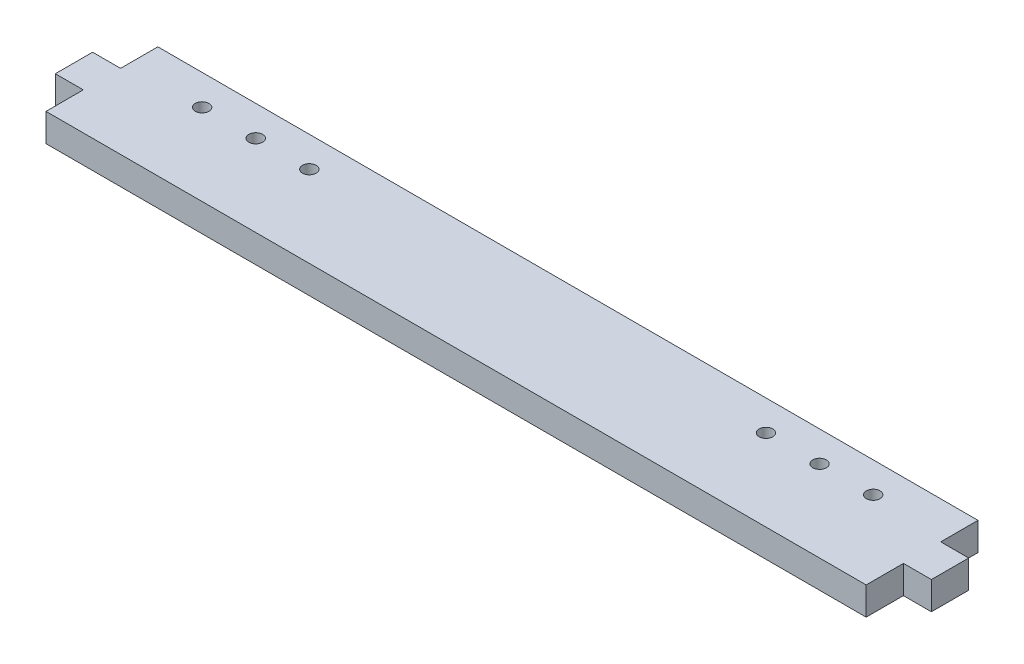
ISO-10303-21;
HEADER;
FILE_DESCRIPTION(('STEP AP214'),'2;1');
FILE_NAME('part.step','',(''),(''),'','','');
FILE_SCHEMA(('AUTOMOTIVE_DESIGN { 1 0 10303 214 1 1 1 1 }'));
ENDSEC;
DATA;
#1=APPLICATION_CONTEXT('core data for automotive mechanical design processes');
#2=APPLICATION_PROTOCOL_DEFINITION('international standard','automotive_design',2000,#1);
#3=PRODUCT_CONTEXT('',#1,'mechanical');
#4=PRODUCT('Part','Part','',(#3));
#5=PRODUCT_RELATED_PRODUCT_CATEGORY('part','',(#4));
#6=PRODUCT_DEFINITION_FORMATION('','',#4);
#7=PRODUCT_DEFINITION_CONTEXT('part definition',#1,'design');
#8=PRODUCT_DEFINITION('design','',#6,#7);
#9=PRODUCT_DEFINITION_SHAPE('','',#8);
#10=(LENGTH_UNIT() NAMED_UNIT(*) SI_UNIT(.MILLI.,.METRE.));
#11=(NAMED_UNIT(*) PLANE_ANGLE_UNIT() SI_UNIT($,.RADIAN.));
#12=(NAMED_UNIT(*) SI_UNIT($,.STERADIAN.) SOLID_ANGLE_UNIT());
#13=UNCERTAINTY_MEASURE_WITH_UNIT(LENGTH_MEASURE(1.E-05),#10,'distance_accuracy_value','');
#14=(GEOMETRIC_REPRESENTATION_CONTEXT(3) GLOBAL_UNCERTAINTY_ASSIGNED_CONTEXT((#13)) GLOBAL_UNIT_ASSIGNED_CONTEXT((#10,
#11,#12)) REPRESENTATION_CONTEXT('',''));
#15=CARTESIAN_POINT('',(0.,0.,0.));
#16=DIRECTION('',(0.,0.,1.));
#17=DIRECTION('',(1.,0.,0.));
#18=AXIS2_PLACEMENT_3D('',#15,#16,#17);
#19=CARTESIAN_POINT('',(-139.7,9.525,19.05));
#20=DIRECTION('',(1.,0.,0.));
#21=DIRECTION('',(0.,0.,-1.));
#22=AXIS2_PLACEMENT_3D('',#19,#20,#21);
#23=PLANE('',#22);
#24=DIRECTION('',(0.,0.,1.));
#25=VECTOR('',#24,1.);
#26=CARTESIAN_POINT('',(-139.7,9.525,19.05));
#27=LINE('',#26,#25);
#28=CARTESIAN_POINT('',(-139.7,9.525,6.34999999999999));
#29=VERTEX_POINT('',#28);
#30=CARTESIAN_POINT('',(-139.7,9.525,19.05));
#31=VERTEX_POINT('',#30);
#32=EDGE_CURVE('E193',#29,#31,#27,.T.);
#33=ORIENTED_EDGE('',*,*,#32,.F.);
#34=DIRECTION('',(0.,-1.,0.));
#35=VECTOR('',#34,1.);
#36=CARTESIAN_POINT('',(-139.7,0.,6.34999999999999));
#37=LINE('',#36,#35);
#38=CARTESIAN_POINT('',(-139.7,0.,6.34999999999999));
#39=VERTEX_POINT('',#38);
#40=EDGE_CURVE('E134',#29,#39,#37,.T.);
#41=ORIENTED_EDGE('',*,*,#40,.T.);
#42=DIRECTION('',(0.,0.,1.));
#43=VECTOR('',#42,1.);
#44=CARTESIAN_POINT('',(-139.7,0.,19.05));
#45=LINE('',#44,#43);
#46=CARTESIAN_POINT('',(-139.7,0.,19.05));
#47=VERTEX_POINT('',#46);
#48=EDGE_CURVE('E189',#39,#47,#45,.T.);
#49=ORIENTED_EDGE('',*,*,#48,.T.);
#50=DIRECTION('',(0.,-1.,0.));
#51=VECTOR('',#50,1.);
#52=CARTESIAN_POINT('',(-139.7,9.525,19.05));
#53=LINE('',#52,#51);
#54=EDGE_CURVE('E11',#31,#47,#53,.T.);
#55=ORIENTED_EDGE('',*,*,#54,.F.);
#56=EDGE_LOOP('',(#33,#41,#49,#55));
#57=FACE_BOUND('',#56,.T.);
#58=ADVANCED_FACE('F37',(#57),#23,.F.);
#59=CARTESIAN_POINT('',(139.7,9.525,19.05));
#60=DIRECTION('',(-1.,0.,0.));
#61=DIRECTION('',(0.,0.,1.));
#62=AXIS2_PLACEMENT_3D('',#59,#60,#61);
#63=PLANE('',#62);
#64=DIRECTION('',(0.,-1.,0.));
#65=VECTOR('',#64,1.);
#66=CARTESIAN_POINT('',(139.7,0.,6.34999999999999));
#67=LINE('',#66,#65);
#68=CARTESIAN_POINT('',(139.7,9.525,6.34999999999999));
#69=VERTEX_POINT('',#68);
#70=CARTESIAN_POINT('',(139.7,0.,6.34999999999999));
#71=VERTEX_POINT('',#70);
#72=EDGE_CURVE('E60',#69,#71,#67,.T.);
#73=ORIENTED_EDGE('',*,*,#72,.F.);
#74=DIRECTION('',(0.,0.,-1.));
#75=VECTOR('',#74,1.);
#76=CARTESIAN_POINT('',(139.7,9.525,19.05));
#77=LINE('',#76,#75);
#78=CARTESIAN_POINT('',(139.7,9.525,19.05));
#79=VERTEX_POINT('',#78);
#80=EDGE_CURVE('E196',#79,#69,#77,.T.);
#81=ORIENTED_EDGE('',*,*,#80,.F.);
#82=DIRECTION('',(0.,-1.,0.));
#83=VECTOR('',#82,1.);
#84=CARTESIAN_POINT('',(139.7,9.525,19.05));
#85=LINE('',#84,#83);
#86=CARTESIAN_POINT('',(139.7,0.,19.05));
#87=VERTEX_POINT('',#86);
#88=EDGE_CURVE('E45',#79,#87,#85,.T.);
#89=ORIENTED_EDGE('',*,*,#88,.T.);
#90=DIRECTION('',(0.,0.,-1.));
#91=VECTOR('',#90,1.);
#92=CARTESIAN_POINT('',(139.7,0.,19.05));
#93=LINE('',#92,#91);
#94=EDGE_CURVE('E207',#87,#71,#93,.T.);
#95=ORIENTED_EDGE('',*,*,#94,.T.);
#96=EDGE_LOOP('',(#73,#81,#89,#95));
#97=FACE_BOUND('',#96,.T.);
#98=ADVANCED_FACE('F218',(#97),#63,.F.);
#99=DIRECTION('',(0.,1.,0.));
#100=VECTOR('',#99,1.);
#101=CARTESIAN_POINT('',(139.7,0.,-6.35000000000001));
#102=LINE('',#101,#100);
#103=CARTESIAN_POINT('',(139.7,0.,-6.35000000000001));
#104=VERTEX_POINT('',#103);
#105=CARTESIAN_POINT('',(139.7,9.525,-6.35000000000001));
#106=VERTEX_POINT('',#105);
#107=EDGE_CURVE('E168',#104,#106,#102,.T.);
#108=ORIENTED_EDGE('',*,*,#107,.F.);
#109=CARTESIAN_POINT('',(139.7,0.,-19.05));
#110=VERTEX_POINT('',#109);
#111=EDGE_CURVE('E206',#104,#110,#93,.T.);
#112=ORIENTED_EDGE('',*,*,#111,.T.);
#113=DIRECTION('',(0.,-1.,0.));
#114=VECTOR('',#113,1.);
#115=CARTESIAN_POINT('',(139.7,9.525,-19.05));
#116=LINE('',#115,#114);
#117=CARTESIAN_POINT('',(139.7,9.525,-19.05));
#118=VERTEX_POINT('',#117);
#119=EDGE_CURVE('E213',#118,#110,#116,.T.);
#120=ORIENTED_EDGE('',*,*,#119,.F.);
#121=EDGE_CURVE('E195',#106,#118,#77,.T.);
#122=ORIENTED_EDGE('',*,*,#121,.F.);
#123=EDGE_LOOP('',(#108,#112,#120,#122));
#124=FACE_BOUND('',#123,.T.);
#125=ADVANCED_FACE('F265',(#124),#63,.F.);
#126=CARTESIAN_POINT('',(-139.7,0.,-19.05));
#127=VERTEX_POINT('',#126);
#128=CARTESIAN_POINT('',(-139.7,0.,-6.35000000000001));
#129=VERTEX_POINT('',#128);
#130=EDGE_CURVE('E201',#127,#129,#45,.T.);
#131=ORIENTED_EDGE('',*,*,#130,.T.);
#132=DIRECTION('',(0.,1.,0.));
#133=VECTOR('',#132,1.);
#134=CARTESIAN_POINT('',(-139.7,0.,-6.35000000000001));
#135=LINE('',#134,#133);
#136=CARTESIAN_POINT('',(-139.7,9.525,-6.35));
#137=VERTEX_POINT('',#136);
#138=EDGE_CURVE('E146',#129,#137,#135,.T.);
#139=ORIENTED_EDGE('',*,*,#138,.T.);
#140=CARTESIAN_POINT('',(-139.7,9.525,-19.05));
#141=VERTEX_POINT('',#140);
#142=EDGE_CURVE('E190',#141,#137,#27,.T.);
#143=ORIENTED_EDGE('',*,*,#142,.F.);
#144=DIRECTION('',(0.,-1.,0.));
#145=VECTOR('',#144,1.);
#146=CARTESIAN_POINT('',(-139.7,9.525,-19.05));
#147=LINE('',#146,#145);
#148=EDGE_CURVE('E200',#141,#127,#147,.T.);
#149=ORIENTED_EDGE('',*,*,#148,.T.);
#150=EDGE_LOOP('',(#131,#139,#143,#149));
#151=FACE_BOUND('',#150,.T.);
#152=ADVANCED_FACE('F39',(#151),#23,.F.);
#153=CARTESIAN_POINT('',(139.7,9.525,19.05));
#154=DIRECTION('',(0.,0.,-1.));
#155=DIRECTION('',(-1.,0.,0.));
#156=AXIS2_PLACEMENT_3D('',#153,#154,#155);
#157=PLANE('',#156);
#158=DIRECTION('',(1.,0.,0.));
#159=VECTOR('',#158,1.);
#160=CARTESIAN_POINT('',(139.7,0.,19.05));
#161=LINE('',#160,#159);
#162=EDGE_CURVE('E204',#47,#87,#161,.T.);
#163=ORIENTED_EDGE('',*,*,#162,.T.);
#164=ORIENTED_EDGE('',*,*,#88,.F.);
#165=DIRECTION('',(1.,0.,0.));
#166=VECTOR('',#165,1.);
#167=CARTESIAN_POINT('',(139.7,9.525,19.05));
#168=LINE('',#167,#166);
#169=EDGE_CURVE('E192',#31,#79,#168,.T.);
#170=ORIENTED_EDGE('',*,*,#169,.F.);
#171=ORIENTED_EDGE('',*,*,#54,.T.);
#172=EDGE_LOOP('',(#163,#164,#170,#171));
#173=FACE_BOUND('',#172,.T.);
#174=ADVANCED_FACE('F234',(#173),#157,.F.);
#175=CARTESIAN_POINT('',(139.7,9.525,-19.05));
#176=DIRECTION('',(0.,0.,1.));
#177=DIRECTION('',(1.,0.,0.));
#178=AXIS2_PLACEMENT_3D('',#175,#176,#177);
#179=PLANE('',#178);
#180=DIRECTION('',(-1.,0.,0.));
#181=VECTOR('',#180,1.);
#182=CARTESIAN_POINT('',(139.7,0.,-19.05));
#183=LINE('',#182,#181);
#184=EDGE_CURVE('E209',#110,#127,#183,.T.);
#185=ORIENTED_EDGE('',*,*,#184,.T.);
#186=ORIENTED_EDGE('',*,*,#148,.F.);
#187=DIRECTION('',(-1.,0.,0.));
#188=VECTOR('',#187,1.);
#189=CARTESIAN_POINT('',(139.7,9.525,-19.05));
#190=LINE('',#189,#188);
#191=EDGE_CURVE('E198',#118,#141,#190,.T.);
#192=ORIENTED_EDGE('',*,*,#191,.F.);
#193=ORIENTED_EDGE('',*,*,#119,.T.);
#194=EDGE_LOOP('',(#185,#186,#192,#193));
#195=FACE_BOUND('',#194,.T.);
#196=ADVANCED_FACE('F243',(#195),#179,.F.);
#197=CARTESIAN_POINT('',(0.,9.525,0.));
#198=DIRECTION('',(0.,1.,0.));
#199=DIRECTION('',(0.,0.,1.));
#200=AXIS2_PLACEMENT_3D('',#197,#198,#199);
#201=PLANE('',#200);
#202=CARTESIAN_POINT('',(-114.3,9.525,-8.73760000000001));
#203=DIRECTION('',(0.,1.,0.));
#204=DIRECTION('',(0.,0.,-1.));
#205=AXIS2_PLACEMENT_3D('',#202,#203,#204);
#206=CIRCLE('',#205,2.3368);
#207=CARTESIAN_POINT('',(-114.3,9.525,-11.0744));
#208=VERTEX_POINT('',#207);
#209=EDGE_CURVE('E421',#208,#208,#206,.T.);
#210=ORIENTED_EDGE('',*,*,#209,.F.);
#211=EDGE_LOOP('',(#210));
#212=FACE_BOUND('',#211,.T.);
#213=CARTESIAN_POINT('',(-77.7748,9.525,-8.73760000000002));
#214=DIRECTION('',(0.,1.,0.));
#215=DIRECTION('',(0.,0.,-1.));
#216=AXIS2_PLACEMENT_3D('',#213,#214,#215);
#217=CIRCLE('',#216,2.3368);
#218=CARTESIAN_POINT('',(-77.7748,9.525,-11.0744));
#219=VERTEX_POINT('',#218);
#220=EDGE_CURVE('E425',#219,#219,#217,.T.);
#221=ORIENTED_EDGE('',*,*,#220,.F.);
#222=EDGE_LOOP('',(#221));
#223=FACE_BOUND('',#222,.T.);
#224=CARTESIAN_POINT('',(-96.0374,9.525,-8.73760000000002));
#225=DIRECTION('',(0.,1.,0.));
#226=DIRECTION('',(0.,0.,-1.));
#227=AXIS2_PLACEMENT_3D('',#224,#225,#226);
#228=CIRCLE('',#227,2.3368);
#229=CARTESIAN_POINT('',(-96.0374,9.525,-11.0744));
#230=VERTEX_POINT('',#229);
#231=EDGE_CURVE('E435',#230,#230,#228,.T.);
#232=ORIENTED_EDGE('',*,*,#231,.F.);
#233=EDGE_LOOP('',(#232));
#234=FACE_BOUND('',#233,.T.);
#235=CARTESIAN_POINT('',(114.3,9.525,-8.73760000000001));
#236=DIRECTION('',(0.,-1.,0.));
#237=DIRECTION('',(0.,0.,-1.));
#238=AXIS2_PLACEMENT_3D('',#235,#236,#237);
#239=CIRCLE('',#238,2.3368);
#240=CARTESIAN_POINT('',(114.3,9.525,-11.0744));
#241=VERTEX_POINT('',#240);
#242=EDGE_CURVE('E158',#241,#241,#239,.T.);
#243=ORIENTED_EDGE('',*,*,#242,.T.);
#244=EDGE_LOOP('',(#243));
#245=FACE_BOUND('',#244,.T.);
#246=CARTESIAN_POINT('',(77.7748,9.525,-8.73760000000002));
#247=DIRECTION('',(0.,-1.,0.));
#248=DIRECTION('',(0.,0.,-1.));
#249=AXIS2_PLACEMENT_3D('',#246,#247,#248);
#250=CIRCLE('',#249,2.3368);
#251=CARTESIAN_POINT('',(77.7748,9.525,-11.0744));
#252=VERTEX_POINT('',#251);
#253=EDGE_CURVE('E449',#252,#252,#250,.T.);
#254=ORIENTED_EDGE('',*,*,#253,.T.);
#255=EDGE_LOOP('',(#254));
#256=FACE_BOUND('',#255,.T.);
#257=CARTESIAN_POINT('',(96.0374,9.525,-8.73760000000002));
#258=DIRECTION('',(0.,-1.,0.));
#259=DIRECTION('',(0.,0.,-1.));
#260=AXIS2_PLACEMENT_3D('',#257,#258,#259);
#261=CIRCLE('',#260,2.3368);
#262=CARTESIAN_POINT('',(96.0374,9.525,-11.0744));
#263=VERTEX_POINT('',#262);
#264=EDGE_CURVE('E427',#263,#263,#261,.T.);
#265=ORIENTED_EDGE('',*,*,#264,.T.);
#266=EDGE_LOOP('',(#265));
#267=FACE_BOUND('',#266,.T.);
#268=ORIENTED_EDGE('',*,*,#142,.T.);
#269=DIRECTION('',(1.,0.,0.));
#270=VECTOR('',#269,1.);
#271=CARTESIAN_POINT('',(-149.225,9.525,-6.35000000000001));
#272=LINE('',#271,#270);
#273=CARTESIAN_POINT('',(-149.225,9.525,-6.35000000000001));
#274=VERTEX_POINT('',#273);
#275=EDGE_CURVE('E52',#274,#137,#272,.T.);
#276=ORIENTED_EDGE('',*,*,#275,.F.);
#277=DIRECTION('',(0.,0.,1.));
#278=VECTOR('',#277,1.);
#279=CARTESIAN_POINT('',(-149.225,9.525,6.34999999999999));
#280=LINE('',#279,#278);
#281=CARTESIAN_POINT('',(-149.225,9.525,6.34999999999999));
#282=VERTEX_POINT('',#281);
#283=EDGE_CURVE('E143',#274,#282,#280,.T.);
#284=ORIENTED_EDGE('',*,*,#283,.T.);
#285=DIRECTION('',(1.,0.,0.));
#286=VECTOR('',#285,1.);
#287=CARTESIAN_POINT('',(-149.225,9.525,6.34999999999999));
#288=LINE('',#287,#286);
#289=EDGE_CURVE('E128',#282,#29,#288,.T.);
#290=ORIENTED_EDGE('',*,*,#289,.T.);
#291=ORIENTED_EDGE('',*,*,#32,.T.);
#292=ORIENTED_EDGE('',*,*,#169,.T.);
#293=ORIENTED_EDGE('',*,*,#80,.T.);
#294=DIRECTION('',(-1.,0.,0.));
#295=VECTOR('',#294,1.);
#296=CARTESIAN_POINT('',(149.225,9.525,6.34999999999999));
#297=LINE('',#296,#295);
#298=CARTESIAN_POINT('',(149.225,9.525,6.34999999999999));
#299=VERTEX_POINT('',#298);
#300=EDGE_CURVE('E174',#299,#69,#297,.T.);
#301=ORIENTED_EDGE('',*,*,#300,.F.);
#302=DIRECTION('',(0.,0.,1.));
#303=VECTOR('',#302,1.);
#304=CARTESIAN_POINT('',(149.225,9.525,6.34999999999999));
#305=LINE('',#304,#303);
#306=CARTESIAN_POINT('',(149.225,9.525,-6.35000000000001));
#307=VERTEX_POINT('',#306);
#308=EDGE_CURVE('E172',#307,#299,#305,.T.);
#309=ORIENTED_EDGE('',*,*,#308,.F.);
#310=DIRECTION('',(-1.,0.,0.));
#311=VECTOR('',#310,1.);
#312=CARTESIAN_POINT('',(149.225,9.525,-6.35000000000001));
#313=LINE('',#312,#311);
#314=EDGE_CURVE('E180',#307,#106,#313,.T.);
#315=ORIENTED_EDGE('',*,*,#314,.T.);
#316=ORIENTED_EDGE('',*,*,#121,.T.);
#317=ORIENTED_EDGE('',*,*,#191,.T.);
#318=EDGE_LOOP('',(#268,#276,#284,#290,#291,#292,#293,#301,#309,#315,#316,#317));
#319=FACE_BOUND('',#318,.T.);
#320=ADVANCED_FACE('F149',(#212,#223,#234,#245,#256,#267,#319),#201,.T.);
#321=CARTESIAN_POINT('',(0.,0.,0.));
#322=DIRECTION('',(0.,1.,0.));
#323=DIRECTION('',(0.,0.,1.));
#324=AXIS2_PLACEMENT_3D('',#321,#322,#323);
#325=PLANE('',#324);
#326=CARTESIAN_POINT('',(-114.3,0.,-8.73760000000001));
#327=DIRECTION('',(0.,1.,0.));
#328=DIRECTION('',(0.,0.,-1.));
#329=AXIS2_PLACEMENT_3D('',#326,#327,#328);
#330=CIRCLE('',#329,2.3368);
#331=CARTESIAN_POINT('',(-114.3,0.,-11.0744));
#332=VERTEX_POINT('',#331);
#333=EDGE_CURVE('E424',#332,#332,#330,.T.);
#334=ORIENTED_EDGE('',*,*,#333,.T.);
#335=EDGE_LOOP('',(#334));
#336=FACE_BOUND('',#335,.T.);
#337=CARTESIAN_POINT('',(-77.7748,0.,-8.73760000000002));
#338=DIRECTION('',(0.,1.,0.));
#339=DIRECTION('',(0.,0.,-1.));
#340=AXIS2_PLACEMENT_3D('',#337,#338,#339);
#341=CIRCLE('',#340,2.3368);
#342=CARTESIAN_POINT('',(-77.7748,0.,-11.0744));
#343=VERTEX_POINT('',#342);
#344=EDGE_CURVE('E430',#343,#343,#341,.T.);
#345=ORIENTED_EDGE('',*,*,#344,.T.);
#346=EDGE_LOOP('',(#345));
#347=FACE_BOUND('',#346,.T.);
#348=CARTESIAN_POINT('',(-96.0374,0.,-8.73760000000002));
#349=DIRECTION('',(0.,1.,0.));
#350=DIRECTION('',(0.,0.,-1.));
#351=AXIS2_PLACEMENT_3D('',#348,#349,#350);
#352=CIRCLE('',#351,2.3368);
#353=CARTESIAN_POINT('',(-96.0374,0.,-11.0744));
#354=VERTEX_POINT('',#353);
#355=EDGE_CURVE('E438',#354,#354,#352,.T.);
#356=ORIENTED_EDGE('',*,*,#355,.T.);
#357=EDGE_LOOP('',(#356));
#358=FACE_BOUND('',#357,.T.);
#359=CARTESIAN_POINT('',(114.3,0.,-8.73760000000001));
#360=DIRECTION('',(0.,-1.,0.));
#361=DIRECTION('',(0.,0.,-1.));
#362=AXIS2_PLACEMENT_3D('',#359,#360,#361);
#363=CIRCLE('',#362,2.3368);
#364=CARTESIAN_POINT('',(114.3,0.,-11.0744));
#365=VERTEX_POINT('',#364);
#366=EDGE_CURVE('E443',#365,#365,#363,.T.);
#367=ORIENTED_EDGE('',*,*,#366,.F.);
#368=EDGE_LOOP('',(#367));
#369=FACE_BOUND('',#368,.T.);
#370=CARTESIAN_POINT('',(77.7748,0.,-8.73760000000002));
#371=DIRECTION('',(0.,-1.,0.));
#372=DIRECTION('',(0.,0.,-1.));
#373=AXIS2_PLACEMENT_3D('',#370,#371,#372);
#374=CIRCLE('',#373,2.3368);
#375=CARTESIAN_POINT('',(77.7748,0.,-11.0744));
#376=VERTEX_POINT('',#375);
#377=EDGE_CURVE('E446',#376,#376,#374,.T.);
#378=ORIENTED_EDGE('',*,*,#377,.F.);
#379=EDGE_LOOP('',(#378));
#380=FACE_BOUND('',#379,.T.);
#381=CARTESIAN_POINT('',(96.0374,0.,-8.73760000000002));
#382=DIRECTION('',(0.,-1.,0.));
#383=DIRECTION('',(0.,0.,-1.));
#384=AXIS2_PLACEMENT_3D('',#381,#382,#383);
#385=CIRCLE('',#384,2.3368);
#386=CARTESIAN_POINT('',(96.0374,0.,-11.0744));
#387=VERTEX_POINT('',#386);
#388=EDGE_CURVE('E452',#387,#387,#385,.T.);
#389=ORIENTED_EDGE('',*,*,#388,.F.);
#390=EDGE_LOOP('',(#389));
#391=FACE_BOUND('',#390,.T.);
#392=ORIENTED_EDGE('',*,*,#130,.F.);
#393=ORIENTED_EDGE('',*,*,#184,.F.);
#394=ORIENTED_EDGE('',*,*,#111,.F.);
#395=DIRECTION('',(-1.,0.,0.));
#396=VECTOR('',#395,1.);
#397=CARTESIAN_POINT('',(149.225,0.,-6.35000000000001));
#398=LINE('',#397,#396);
#399=CARTESIAN_POINT('',(149.225,0.,-6.35000000000001));
#400=VERTEX_POINT('',#399);
#401=EDGE_CURVE('E183',#400,#104,#398,.T.);
#402=ORIENTED_EDGE('',*,*,#401,.F.);
#403=DIRECTION('',(0.,0.,-1.));
#404=VECTOR('',#403,1.);
#405=CARTESIAN_POINT('',(149.225,0.,6.34999999999999));
#406=LINE('',#405,#404);
#407=CARTESIAN_POINT('',(149.225,0.,6.34999999999999));
#408=VERTEX_POINT('',#407);
#409=EDGE_CURVE('E167',#408,#400,#406,.T.);
#410=ORIENTED_EDGE('',*,*,#409,.F.);
#411=DIRECTION('',(-1.,0.,0.));
#412=VECTOR('',#411,1.);
#413=CARTESIAN_POINT('',(149.225,0.,6.34999999999999));
#414=LINE('',#413,#412);
#415=EDGE_CURVE('E186',#408,#71,#414,.T.);
#416=ORIENTED_EDGE('',*,*,#415,.T.);
#417=ORIENTED_EDGE('',*,*,#94,.F.);
#418=ORIENTED_EDGE('',*,*,#162,.F.);
#419=ORIENTED_EDGE('',*,*,#48,.F.);
#420=DIRECTION('',(1.,0.,0.));
#421=VECTOR('',#420,1.);
#422=CARTESIAN_POINT('',(-149.225,0.,6.34999999999999));
#423=LINE('',#422,#421);
#424=CARTESIAN_POINT('',(-149.225,0.,6.34999999999999));
#425=VERTEX_POINT('',#424);
#426=EDGE_CURVE('E156',#425,#39,#423,.T.);
#427=ORIENTED_EDGE('',*,*,#426,.F.);
#428=DIRECTION('',(0.,0.,-1.));
#429=VECTOR('',#428,1.);
#430=CARTESIAN_POINT('',(-149.225,0.,6.34999999999999));
#431=LINE('',#430,#429);
#432=CARTESIAN_POINT('',(-149.225,0.,-6.35000000000001));
#433=VERTEX_POINT('',#432);
#434=EDGE_CURVE('E145',#425,#433,#431,.T.);
#435=ORIENTED_EDGE('',*,*,#434,.T.);
#436=DIRECTION('',(1.,0.,0.));
#437=VECTOR('',#436,1.);
#438=CARTESIAN_POINT('',(-149.225,0.,-6.35000000000001));
#439=LINE('',#438,#437);
#440=EDGE_CURVE('E161',#433,#129,#439,.T.);
#441=ORIENTED_EDGE('',*,*,#440,.T.);
#442=EDGE_LOOP('',(#392,#393,#394,#402,#410,#416,#417,#418,#419,#427,#435,#441));
#443=FACE_BOUND('',#442,.T.);
#444=ADVANCED_FACE('F224',(#336,#347,#358,#369,#380,#391,#443),#325,.F.);
#445=CARTESIAN_POINT('',(149.225,0.,6.34999999999999));
#446=DIRECTION('',(0.,0.,-1.));
#447=DIRECTION('',(-1.,0.,0.));
#448=AXIS2_PLACEMENT_3D('',#445,#446,#447);
#449=PLANE('',#448);
#450=ORIENTED_EDGE('',*,*,#72,.T.);
#451=ORIENTED_EDGE('',*,*,#415,.F.);
#452=DIRECTION('',(0.,-1.,0.));
#453=VECTOR('',#452,1.);
#454=CARTESIAN_POINT('',(149.225,0.,6.34999999999999));
#455=LINE('',#454,#453);
#456=EDGE_CURVE('E164',#299,#408,#455,.T.);
#457=ORIENTED_EDGE('',*,*,#456,.F.);
#458=ORIENTED_EDGE('',*,*,#300,.T.);
#459=EDGE_LOOP('',(#450,#451,#457,#458));
#460=FACE_BOUND('',#459,.T.);
#461=ADVANCED_FACE('F230',(#460),#449,.F.);
#462=CARTESIAN_POINT('',(149.225,0.,-6.35000000000001));
#463=DIRECTION('',(0.,0.,1.));
#464=DIRECTION('',(1.,0.,0.));
#465=AXIS2_PLACEMENT_3D('',#462,#463,#464);
#466=PLANE('',#465);
#467=ORIENTED_EDGE('',*,*,#107,.T.);
#468=ORIENTED_EDGE('',*,*,#314,.F.);
#469=DIRECTION('',(0.,1.,0.));
#470=VECTOR('',#469,1.);
#471=CARTESIAN_POINT('',(149.225,0.,-6.35000000000001));
#472=LINE('',#471,#470);
#473=EDGE_CURVE('E170',#400,#307,#472,.T.);
#474=ORIENTED_EDGE('',*,*,#473,.F.);
#475=ORIENTED_EDGE('',*,*,#401,.T.);
#476=EDGE_LOOP('',(#467,#468,#474,#475));
#477=FACE_BOUND('',#476,.T.);
#478=ADVANCED_FACE('F249',(#477),#466,.F.);
#479=CARTESIAN_POINT('',(149.225,0.,0.));
#480=DIRECTION('',(-1.,0.,0.));
#481=DIRECTION('',(0.,0.,1.));
#482=AXIS2_PLACEMENT_3D('',#479,#480,#481);
#483=PLANE('',#482);
#484=ORIENTED_EDGE('',*,*,#456,.T.);
#485=ORIENTED_EDGE('',*,*,#409,.T.);
#486=ORIENTED_EDGE('',*,*,#473,.T.);
#487=ORIENTED_EDGE('',*,*,#308,.T.);
#488=EDGE_LOOP('',(#484,#485,#486,#487));
#489=FACE_BOUND('',#488,.T.);
#490=ADVANCED_FACE('F252',(#489),#483,.F.);
#491=CARTESIAN_POINT('',(-149.225,0.,6.34999999999999));
#492=DIRECTION('',(0.,0.,1.));
#493=DIRECTION('',(1.,0.,0.));
#494=AXIS2_PLACEMENT_3D('',#491,#492,#493);
#495=PLANE('',#494);
#496=ORIENTED_EDGE('',*,*,#40,.F.);
#497=ORIENTED_EDGE('',*,*,#289,.F.);
#498=DIRECTION('',(0.,-1.,0.));
#499=VECTOR('',#498,1.);
#500=CARTESIAN_POINT('',(-149.225,0.,6.34999999999999));
#501=LINE('',#500,#499);
#502=EDGE_CURVE('E131',#282,#425,#501,.T.);
#503=ORIENTED_EDGE('',*,*,#502,.T.);
#504=ORIENTED_EDGE('',*,*,#426,.T.);
#505=EDGE_LOOP('',(#496,#497,#503,#504));
#506=FACE_BOUND('',#505,.T.);
#507=ADVANCED_FACE('F130',(#506),#495,.T.);
#508=CARTESIAN_POINT('',(-149.225,0.,-6.35000000000001));
#509=DIRECTION('',(0.,0.,-1.));
#510=DIRECTION('',(-1.,0.,0.));
#511=AXIS2_PLACEMENT_3D('',#508,#509,#510);
#512=PLANE('',#511);
#513=ORIENTED_EDGE('',*,*,#138,.F.);
#514=ORIENTED_EDGE('',*,*,#440,.F.);
#515=DIRECTION('',(0.,1.,0.));
#516=VECTOR('',#515,1.);
#517=CARTESIAN_POINT('',(-149.225,0.,-6.35000000000001));
#518=LINE('',#517,#516);
#519=EDGE_CURVE('E150',#433,#274,#518,.T.);
#520=ORIENTED_EDGE('',*,*,#519,.T.);
#521=ORIENTED_EDGE('',*,*,#275,.T.);
#522=EDGE_LOOP('',(#513,#514,#520,#521));
#523=FACE_BOUND('',#522,.T.);
#524=ADVANCED_FACE('F237',(#523),#512,.T.);
#525=CARTESIAN_POINT('',(-149.225,0.,0.));
#526=DIRECTION('',(1.,0.,0.));
#527=DIRECTION('',(0.,0.,1.));
#528=AXIS2_PLACEMENT_3D('',#525,#526,#527);
#529=PLANE('',#528);
#530=ORIENTED_EDGE('',*,*,#502,.F.);
#531=ORIENTED_EDGE('',*,*,#283,.F.);
#532=ORIENTED_EDGE('',*,*,#519,.F.);
#533=ORIENTED_EDGE('',*,*,#434,.F.);
#534=EDGE_LOOP('',(#530,#531,#532,#533));
#535=FACE_BOUND('',#534,.T.);
#536=ADVANCED_FACE('F141',(#535),#529,.F.);
#537=CARTESIAN_POINT('',(96.0374,9.525,-8.73760000000002));
#538=DIRECTION('',(0.,-1.,0.));
#539=DIRECTION('',(0.,0.,-1.));
#540=AXIS2_PLACEMENT_3D('',#537,#538,#539);
#541=CYLINDRICAL_SURFACE('',#540,2.3368);
#542=ORIENTED_EDGE('',*,*,#264,.F.);
#543=EDGE_LOOP('',(#542));
#544=FACE_BOUND('',#543,.T.);
#545=ORIENTED_EDGE('',*,*,#388,.T.);
#546=EDGE_LOOP('',(#545));
#547=FACE_BOUND('',#546,.T.);
#548=ADVANCED_FACE('F335',(#544,#547),#541,.F.);
#549=CARTESIAN_POINT('',(77.7748,9.525,-8.73760000000002));
#550=DIRECTION('',(0.,-1.,0.));
#551=DIRECTION('',(0.,0.,-1.));
#552=AXIS2_PLACEMENT_3D('',#549,#550,#551);
#553=CYLINDRICAL_SURFACE('',#552,2.3368);
#554=ORIENTED_EDGE('',*,*,#253,.F.);
#555=EDGE_LOOP('',(#554));
#556=FACE_BOUND('',#555,.T.);
#557=ORIENTED_EDGE('',*,*,#377,.T.);
#558=EDGE_LOOP('',(#557));
#559=FACE_BOUND('',#558,.T.);
#560=ADVANCED_FACE('F345',(#556,#559),#553,.F.);
#561=CARTESIAN_POINT('',(114.3,9.525,-8.73760000000001));
#562=DIRECTION('',(0.,-1.,0.));
#563=DIRECTION('',(0.,0.,-1.));
#564=AXIS2_PLACEMENT_3D('',#561,#562,#563);
#565=CYLINDRICAL_SURFACE('',#564,2.3368);
#566=ORIENTED_EDGE('',*,*,#242,.F.);
#567=EDGE_LOOP('',(#566));
#568=FACE_BOUND('',#567,.T.);
#569=ORIENTED_EDGE('',*,*,#366,.T.);
#570=EDGE_LOOP('',(#569));
#571=FACE_BOUND('',#570,.T.);
#572=ADVANCED_FACE('F356',(#568,#571),#565,.F.);
#573=CARTESIAN_POINT('',(-96.0374,9.525,-8.73760000000002));
#574=DIRECTION('',(0.,-1.,0.));
#575=DIRECTION('',(0.,0.,-1.));
#576=AXIS2_PLACEMENT_3D('',#573,#574,#575);
#577=CYLINDRICAL_SURFACE('',#576,2.3368);
#578=ORIENTED_EDGE('',*,*,#231,.T.);
#579=EDGE_LOOP('',(#578));
#580=FACE_BOUND('',#579,.T.);
#581=ORIENTED_EDGE('',*,*,#355,.F.);
#582=EDGE_LOOP('',(#581));
#583=FACE_BOUND('',#582,.T.);
#584=ADVANCED_FACE('F366',(#580,#583),#577,.F.);
#585=CARTESIAN_POINT('',(-77.7748,9.525,-8.73760000000002));
#586=DIRECTION('',(0.,-1.,0.));
#587=DIRECTION('',(0.,0.,-1.));
#588=AXIS2_PLACEMENT_3D('',#585,#586,#587);
#589=CYLINDRICAL_SURFACE('',#588,2.3368);
#590=ORIENTED_EDGE('',*,*,#220,.T.);
#591=EDGE_LOOP('',(#590));
#592=FACE_BOUND('',#591,.T.);
#593=ORIENTED_EDGE('',*,*,#344,.F.);
#594=EDGE_LOOP('',(#593));
#595=FACE_BOUND('',#594,.T.);
#596=ADVANCED_FACE('F382',(#592,#595),#589,.F.);
#597=CARTESIAN_POINT('',(-114.3,9.525,-8.73760000000001));
#598=DIRECTION('',(0.,-1.,0.));
#599=DIRECTION('',(0.,0.,-1.));
#600=AXIS2_PLACEMENT_3D('',#597,#598,#599);
#601=CYLINDRICAL_SURFACE('',#600,2.3368);
#602=ORIENTED_EDGE('',*,*,#209,.T.);
#603=EDGE_LOOP('',(#602));
#604=FACE_BOUND('',#603,.T.);
#605=ORIENTED_EDGE('',*,*,#333,.F.);
#606=EDGE_LOOP('',(#605));
#607=FACE_BOUND('',#606,.T.);
#608=ADVANCED_FACE('F393',(#604,#607),#601,.F.);
#609=CLOSED_SHELL('',(#58,#98,#125,#152,#174,#196,#320,#444,#461,#478,#490,#507,#524,#536,#548,
#560,#572,#584,#596,#608));
#610=MANIFOLD_SOLID_BREP('B2',#609);
#611=ADVANCED_BREP_SHAPE_REPRESENTATION('',(#18,#610),#14);
#612=SHAPE_DEFINITION_REPRESENTATION(#9,#611);
ENDSEC;
END-ISO-10303-21;
